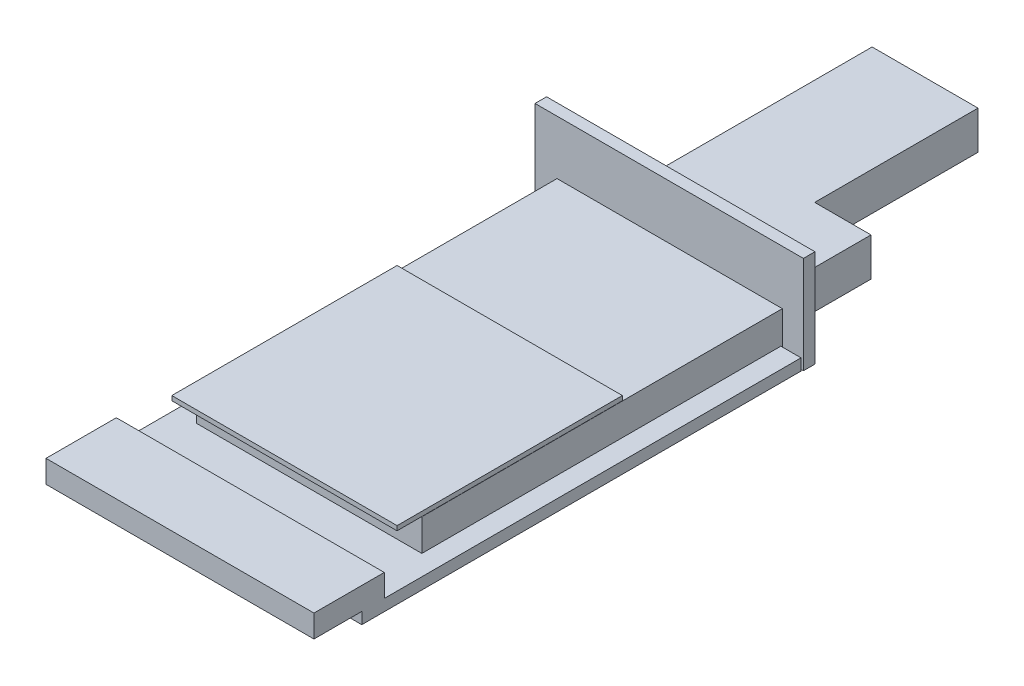
ISO-10303-21;
HEADER;
FILE_DESCRIPTION(('STEP AP214'),'2;1');
FILE_NAME('part.step','',(''),(''),'','','');
FILE_SCHEMA(('AUTOMOTIVE_DESIGN { 1 0 10303 214 1 1 1 1 }'));
ENDSEC;
DATA;
#1=APPLICATION_CONTEXT('core data for automotive mechanical design processes');
#2=APPLICATION_PROTOCOL_DEFINITION('international standard','automotive_design',2000,#1);
#3=PRODUCT_CONTEXT('',#1,'mechanical');
#4=PRODUCT('Part','Part','',(#3));
#5=PRODUCT_RELATED_PRODUCT_CATEGORY('part','',(#4));
#6=PRODUCT_DEFINITION_FORMATION('','',#4);
#7=PRODUCT_DEFINITION_CONTEXT('part definition',#1,'design');
#8=PRODUCT_DEFINITION('design','',#6,#7);
#9=PRODUCT_DEFINITION_SHAPE('','',#8);
#10=(LENGTH_UNIT() NAMED_UNIT(*) SI_UNIT(.MILLI.,.METRE.));
#11=(NAMED_UNIT(*) PLANE_ANGLE_UNIT() SI_UNIT($,.RADIAN.));
#12=(NAMED_UNIT(*) SI_UNIT($,.STERADIAN.) SOLID_ANGLE_UNIT());
#13=UNCERTAINTY_MEASURE_WITH_UNIT(LENGTH_MEASURE(1.E-05),#10,'distance_accuracy_value','');
#14=(GEOMETRIC_REPRESENTATION_CONTEXT(3) GLOBAL_UNCERTAINTY_ASSIGNED_CONTEXT((#13)) GLOBAL_UNIT_ASSIGNED_CONTEXT((#10,
#11,#12)) REPRESENTATION_CONTEXT('',''));
#15=CARTESIAN_POINT('',(0.,0.,0.));
#16=DIRECTION('',(0.,0.,1.));
#17=DIRECTION('',(1.,0.,0.));
#18=AXIS2_PLACEMENT_3D('',#15,#16,#17);
#19=CARTESIAN_POINT('',(-36.3929292491046,27.051,186.581238549588));
#20=DIRECTION('',(0.,0.,-1.));
#21=DIRECTION('',(-1.,0.,0.));
#22=AXIS2_PLACEMENT_3D('',#19,#20,#21);
#23=PLANE('',#22);
#24=DIRECTION('',(1.,0.,0.));
#25=VECTOR('',#24,1.);
#26=CARTESIAN_POINT('',(-36.3929292491046,24.511,186.581238549588));
#27=LINE('',#26,#25);
#28=CARTESIAN_POINT('',(-36.3929292491046,24.511,186.581238549588));
#29=VERTEX_POINT('',#28);
#30=CARTESIAN_POINT('',(90.6070707508954,24.511,186.581238549588));
#31=VERTEX_POINT('',#30);
#32=EDGE_CURVE('E107',#29,#31,#27,.T.);
#33=ORIENTED_EDGE('',*,*,#32,.F.);
#34=DIRECTION('',(0.,-1.,0.));
#35=VECTOR('',#34,1.);
#36=CARTESIAN_POINT('',(-36.3929292491046,27.051,186.581238549588));
#37=LINE('',#36,#35);
#38=CARTESIAN_POINT('',(-36.3929292491046,27.051,186.581238549588));
#39=VERTEX_POINT('',#38);
#40=EDGE_CURVE('E12',#39,#29,#37,.T.);
#41=ORIENTED_EDGE('',*,*,#40,.F.);
#42=DIRECTION('',(1.,0.,0.));
#43=VECTOR('',#42,1.);
#44=CARTESIAN_POINT('',(-36.3929292491046,27.051,186.581238549588));
#45=LINE('',#44,#43);
#46=CARTESIAN_POINT('',(90.6070707508954,27.051,186.581238549588));
#47=VERTEX_POINT('',#46);
#48=EDGE_CURVE('E102',#39,#47,#45,.T.);
#49=ORIENTED_EDGE('',*,*,#48,.T.);
#50=DIRECTION('',(0.,-1.,0.));
#51=VECTOR('',#50,1.);
#52=CARTESIAN_POINT('',(90.6070707508954,27.051,186.581238549588));
#53=LINE('',#52,#51);
#54=EDGE_CURVE('E45',#47,#31,#53,.T.);
#55=ORIENTED_EDGE('',*,*,#54,.T.);
#56=EDGE_LOOP('',(#33,#41,#49,#55));
#57=FACE_BOUND('',#56,.T.);
#58=ADVANCED_FACE('F42',(#57),#23,.T.);
#59=CARTESIAN_POINT('',(-36.3929292491046,27.051,186.581238549588));
#60=DIRECTION('',(1.,0.,0.));
#61=DIRECTION('',(0.,0.,-1.));
#62=AXIS2_PLACEMENT_3D('',#59,#60,#61);
#63=PLANE('',#62);
#64=DIRECTION('',(0.,0.,1.));
#65=VECTOR('',#64,1.);
#66=CARTESIAN_POINT('',(-36.3929292491046,24.511,186.581238549588));
#67=LINE('',#66,#65);
#68=CARTESIAN_POINT('',(-36.3929292491046,24.511,313.581238549588));
#69=VERTEX_POINT('',#68);
#70=EDGE_CURVE('E75',#29,#69,#67,.T.);
#71=ORIENTED_EDGE('',*,*,#70,.T.);
#72=DIRECTION('',(0.,-1.,0.));
#73=VECTOR('',#72,1.);
#74=CARTESIAN_POINT('',(-36.3929292491046,27.051,313.581238549588));
#75=LINE('',#74,#73);
#76=CARTESIAN_POINT('',(-36.3929292491046,27.051,313.581238549588));
#77=VERTEX_POINT('',#76);
#78=EDGE_CURVE('E51',#77,#69,#75,.T.);
#79=ORIENTED_EDGE('',*,*,#78,.F.);
#80=DIRECTION('',(0.,0.,1.));
#81=VECTOR('',#80,1.);
#82=CARTESIAN_POINT('',(-36.3929292491046,27.051,186.581238549588));
#83=LINE('',#82,#81);
#84=EDGE_CURVE('E92',#39,#77,#83,.T.);
#85=ORIENTED_EDGE('',*,*,#84,.F.);
#86=ORIENTED_EDGE('',*,*,#40,.T.);
#87=EDGE_LOOP('',(#71,#79,#85,#86));
#88=FACE_BOUND('',#87,.T.);
#89=ADVANCED_FACE('F117',(#88),#63,.F.);
#90=CARTESIAN_POINT('',(-36.3929292491046,27.051,313.581238549588));
#91=DIRECTION('',(0.,0.,-1.));
#92=DIRECTION('',(-1.,0.,0.));
#93=AXIS2_PLACEMENT_3D('',#90,#91,#92);
#94=PLANE('',#93);
#95=DIRECTION('',(1.,0.,0.));
#96=VECTOR('',#95,1.);
#97=CARTESIAN_POINT('',(-36.3929292491046,24.511,313.581238549588));
#98=LINE('',#97,#96);
#99=CARTESIAN_POINT('',(90.6070707508954,24.511,313.581238549588));
#100=VERTEX_POINT('',#99);
#101=EDGE_CURVE('E99',#69,#100,#98,.T.);
#102=ORIENTED_EDGE('',*,*,#101,.T.);
#103=DIRECTION('',(0.,-1.,0.));
#104=VECTOR('',#103,1.);
#105=CARTESIAN_POINT('',(90.6070707508954,27.051,313.581238549588));
#106=LINE('',#105,#104);
#107=CARTESIAN_POINT('',(90.6070707508954,27.051,313.581238549588));
#108=VERTEX_POINT('',#107);
#109=EDGE_CURVE('E96',#108,#100,#106,.T.);
#110=ORIENTED_EDGE('',*,*,#109,.F.);
#111=DIRECTION('',(1.,0.,0.));
#112=VECTOR('',#111,1.);
#113=CARTESIAN_POINT('',(-36.3929292491046,27.051,313.581238549588));
#114=LINE('',#113,#112);
#115=EDGE_CURVE('E87',#77,#108,#114,.T.);
#116=ORIENTED_EDGE('',*,*,#115,.F.);
#117=ORIENTED_EDGE('',*,*,#78,.T.);
#118=EDGE_LOOP('',(#102,#110,#116,#117));
#119=FACE_BOUND('',#118,.T.);
#120=ADVANCED_FACE('F97',(#119),#94,.F.);
#121=CARTESIAN_POINT('',(90.6070707508954,27.051,186.581238549588));
#122=DIRECTION('',(1.,0.,0.));
#123=DIRECTION('',(0.,0.,-1.));
#124=AXIS2_PLACEMENT_3D('',#121,#122,#123);
#125=PLANE('',#124);
#126=DIRECTION('',(0.,0.,1.));
#127=VECTOR('',#126,1.);
#128=CARTESIAN_POINT('',(90.6070707508954,24.511,186.581238549588));
#129=LINE('',#128,#127);
#130=EDGE_CURVE('E110',#31,#100,#129,.T.);
#131=ORIENTED_EDGE('',*,*,#130,.F.);
#132=ORIENTED_EDGE('',*,*,#54,.F.);
#133=DIRECTION('',(0.,0.,1.));
#134=VECTOR('',#133,1.);
#135=CARTESIAN_POINT('',(90.6070707508954,27.051,186.581238549588));
#136=LINE('',#135,#134);
#137=EDGE_CURVE('E91',#47,#108,#136,.T.);
#138=ORIENTED_EDGE('',*,*,#137,.T.);
#139=ORIENTED_EDGE('',*,*,#109,.T.);
#140=EDGE_LOOP('',(#131,#132,#138,#139));
#141=FACE_BOUND('',#140,.T.);
#142=ADVANCED_FACE('F101',(#141),#125,.T.);
#143=CARTESIAN_POINT('',(0.,27.051,0.));
#144=DIRECTION('',(0.,-1.,0.));
#145=DIRECTION('',(0.,0.,-1.));
#146=AXIS2_PLACEMENT_3D('',#143,#144,#145);
#147=PLANE('',#146);
#148=ORIENTED_EDGE('',*,*,#48,.F.);
#149=ORIENTED_EDGE('',*,*,#84,.T.);
#150=ORIENTED_EDGE('',*,*,#115,.T.);
#151=ORIENTED_EDGE('',*,*,#137,.F.);
#152=EDGE_LOOP('',(#148,#149,#150,#151));
#153=FACE_BOUND('',#152,.T.);
#154=ADVANCED_FACE('F90',(#153),#147,.F.);
#155=CARTESIAN_POINT('',(0.,24.511,0.));
#156=DIRECTION('',(0.,-1.,0.));
#157=DIRECTION('',(0.,0.,-1.));
#158=AXIS2_PLACEMENT_3D('',#155,#156,#157);
#159=PLANE('',#158);
#160=ORIENTED_EDGE('',*,*,#32,.T.);
#161=ORIENTED_EDGE('',*,*,#130,.T.);
#162=ORIENTED_EDGE('',*,*,#101,.F.);
#163=ORIENTED_EDGE('',*,*,#70,.F.);
#164=EDGE_LOOP('',(#160,#161,#162,#163));
#165=FACE_BOUND('',#164,.T.);
#166=ADVANCED_FACE('F115',(#165),#159,.T.);
#167=CLOSED_SHELL('',(#58,#89,#120,#142,#154,#166));
#168=MANIFOLD_SOLID_BREP('B2',#167);
#169=CARTESIAN_POINT('',(-48.7979055294522,54.864,89.8961385495878));
#170=DIRECTION('',(0.,0.,-1.));
#171=DIRECTION('',(-1.,0.,0.));
#172=AXIS2_PLACEMENT_3D('',#169,#170,#171);
#173=PLANE('',#172);
#174=DIRECTION('',(1.,0.,0.));
#175=VECTOR('',#174,1.);
#176=CARTESIAN_POINT('',(-48.7979055294522,0.,89.8961385495878));
#177=LINE('',#176,#175);
#178=CARTESIAN_POINT('',(-48.7979055294522,0.,89.8961385495878));
#179=VERTEX_POINT('',#178);
#180=CARTESIAN_POINT('',(102.504227111808,0.,89.8961385495878));
#181=VERTEX_POINT('',#180);
#182=EDGE_CURVE('E492',#179,#181,#177,.T.);
#183=ORIENTED_EDGE('',*,*,#182,.F.);
#184=DIRECTION('',(0.,-1.,0.));
#185=VECTOR('',#184,1.);
#186=CARTESIAN_POINT('',(-48.7979055294522,54.864,89.8961385495878));
#187=LINE('',#186,#185);
#188=CARTESIAN_POINT('',(-48.7979055294522,54.864,89.8961385495878));
#189=VERTEX_POINT('',#188);
#190=EDGE_CURVE('E489',#189,#179,#187,.T.);
#191=ORIENTED_EDGE('',*,*,#190,.F.);
#192=DIRECTION('',(1.,0.,0.));
#193=VECTOR('',#192,1.);
#194=CARTESIAN_POINT('',(-48.7979055294522,54.864,89.8961385495878));
#195=LINE('',#194,#193);
#196=CARTESIAN_POINT('',(102.504227111808,54.864,89.8961385495878));
#197=VERTEX_POINT('',#196);
#198=EDGE_CURVE('E481',#189,#197,#195,.T.);
#199=ORIENTED_EDGE('',*,*,#198,.T.);
#200=DIRECTION('',(0.,-1.,0.));
#201=VECTOR('',#200,1.);
#202=CARTESIAN_POINT('',(102.504227111808,54.864,89.8961385495878));
#203=LINE('',#202,#201);
#204=EDGE_CURVE('E506',#197,#181,#203,.T.);
#205=ORIENTED_EDGE('',*,*,#204,.T.);
#206=EDGE_LOOP('',(#183,#191,#199,#205));
#207=FACE_BOUND('',#206,.T.);
#208=DIRECTION('',(1.,0.,0.));
#209=VECTOR('',#208,1.);
#210=CARTESIAN_POINT('',(51.5320944705478,28.067,89.8961385495878));
#211=LINE('',#210,#209);
#212=CARTESIAN_POINT('',(-8.15790552945222,28.067,89.8961385495878));
#213=VERTEX_POINT('',#212);
#214=CARTESIAN_POINT('',(83.2820944705478,28.067,89.8961385495878));
#215=VERTEX_POINT('',#214);
#216=EDGE_CURVE('E363',#213,#215,#211,.T.);
#217=ORIENTED_EDGE('',*,*,#216,.F.);
#218=DIRECTION('',(0.,-1.,0.));
#219=VECTOR('',#218,1.);
#220=CARTESIAN_POINT('',(-8.15790552945222,28.067,89.8961385495878));
#221=LINE('',#220,#219);
#222=CARTESIAN_POINT('',(-8.15790552945222,6.477,89.8961385495878));
#223=VERTEX_POINT('',#222);
#224=EDGE_CURVE('E350',#213,#223,#221,.T.);
#225=ORIENTED_EDGE('',*,*,#224,.T.);
#226=DIRECTION('',(1.,0.,0.));
#227=VECTOR('',#226,1.);
#228=CARTESIAN_POINT('',(51.5320944705478,6.477,89.8961385495878));
#229=LINE('',#228,#227);
#230=CARTESIAN_POINT('',(83.2820944705478,6.477,89.8961385495878));
#231=VERTEX_POINT('',#230);
#232=EDGE_CURVE('E185',#223,#231,#229,.T.);
#233=ORIENTED_EDGE('',*,*,#232,.T.);
#234=DIRECTION('',(0.,-1.,0.));
#235=VECTOR('',#234,1.);
#236=CARTESIAN_POINT('',(83.2820944705478,28.067,89.8961385495878));
#237=LINE('',#236,#235);
#238=EDGE_CURVE('E180',#215,#231,#237,.T.);
#239=ORIENTED_EDGE('',*,*,#238,.F.);
#240=EDGE_LOOP('',(#217,#225,#233,#239));
#241=FACE_BOUND('',#240,.T.);
#242=ADVANCED_FACE('F165',(#207,#241),#173,.T.);
#243=CARTESIAN_POINT('',(-48.7979055294522,54.864,96.4112385495878));
#244=DIRECTION('',(0.,0.,-1.));
#245=DIRECTION('',(-1.,0.,0.));
#246=AXIS2_PLACEMENT_3D('',#243,#244,#245);
#247=PLANE('',#246);
#248=DIRECTION('',(0.,-1.,0.));
#249=VECTOR('',#248,1.);
#250=CARTESIAN_POINT('',(-36.3929292491046,24.384,96.4112385495878));
#251=LINE('',#250,#249);
#252=CARTESIAN_POINT('',(-36.3929292491046,24.384,96.4112385495878));
#253=VERTEX_POINT('',#252);
#254=CARTESIAN_POINT('',(-36.3929292491046,0.,96.4112385495878));
#255=VERTEX_POINT('',#254);
#256=EDGE_CURVE('E467',#253,#255,#251,.T.);
#257=ORIENTED_EDGE('',*,*,#256,.F.);
#258=DIRECTION('',(1.,0.,0.));
#259=VECTOR('',#258,1.);
#260=CARTESIAN_POINT('',(-36.3929292491046,24.384,96.4112385495878));
#261=LINE('',#260,#259);
#262=CARTESIAN_POINT('',(90.6070707508954,24.384,96.4112385495878));
#263=VERTEX_POINT('',#262);
#264=EDGE_CURVE('E451',#253,#263,#261,.T.);
#265=ORIENTED_EDGE('',*,*,#264,.T.);
#266=DIRECTION('',(0.,-1.,0.));
#267=VECTOR('',#266,1.);
#268=CARTESIAN_POINT('',(90.6070707508954,24.384,96.4112385495878));
#269=LINE('',#268,#267);
#270=CARTESIAN_POINT('',(90.6070707508954,0.,96.4112385495878));
#271=VERTEX_POINT('',#270);
#272=EDGE_CURVE('E462',#263,#271,#269,.T.);
#273=ORIENTED_EDGE('',*,*,#272,.T.);
#274=DIRECTION('',(1.,0.,0.));
#275=VECTOR('',#274,1.);
#276=CARTESIAN_POINT('',(-48.7979055294522,0.,96.4112385495878));
#277=LINE('',#276,#275);
#278=CARTESIAN_POINT('',(102.504227111808,0.,96.4112385495878));
#279=VERTEX_POINT('',#278);
#280=EDGE_CURVE('E498',#271,#279,#277,.T.);
#281=ORIENTED_EDGE('',*,*,#280,.T.);
#282=DIRECTION('',(0.,-1.,0.));
#283=VECTOR('',#282,1.);
#284=CARTESIAN_POINT('',(102.504227111808,54.864,96.4112385495878));
#285=LINE('',#284,#283);
#286=CARTESIAN_POINT('',(102.504227111808,54.864,96.4112385495878));
#287=VERTEX_POINT('',#286);
#288=EDGE_CURVE('E503',#287,#279,#285,.T.);
#289=ORIENTED_EDGE('',*,*,#288,.F.);
#290=DIRECTION('',(1.,0.,0.));
#291=VECTOR('',#290,1.);
#292=CARTESIAN_POINT('',(-48.7979055294522,54.864,96.4112385495878));
#293=LINE('',#292,#291);
#294=CARTESIAN_POINT('',(-48.7979055294522,54.864,96.4112385495878));
#295=VERTEX_POINT('',#294);
#296=EDGE_CURVE('E487',#295,#287,#293,.T.);
#297=ORIENTED_EDGE('',*,*,#296,.F.);
#298=DIRECTION('',(0.,-1.,0.));
#299=VECTOR('',#298,1.);
#300=CARTESIAN_POINT('',(-48.7979055294522,54.864,96.4112385495878));
#301=LINE('',#300,#299);
#302=CARTESIAN_POINT('',(-48.7979055294522,0.,96.4112385495878));
#303=VERTEX_POINT('',#302);
#304=EDGE_CURVE('E501',#295,#303,#301,.T.);
#305=ORIENTED_EDGE('',*,*,#304,.T.);
#306=EDGE_CURVE('E482',#303,#255,#277,.T.);
#307=ORIENTED_EDGE('',*,*,#306,.T.);
#308=EDGE_LOOP('',(#257,#265,#273,#281,#289,#297,#305,#307));
#309=FACE_BOUND('',#308,.T.);
#310=ADVANCED_FACE('F553',(#309),#247,.F.);
#311=CARTESIAN_POINT('',(-48.7979055294522,54.864,96.4112385495878));
#312=DIRECTION('',(-1.,0.,0.));
#313=DIRECTION('',(0.,0.,1.));
#314=AXIS2_PLACEMENT_3D('',#311,#312,#313);
#315=PLANE('',#314);
#316=DIRECTION('',(0.,0.,-1.));
#317=VECTOR('',#316,1.);
#318=CARTESIAN_POINT('',(-48.7979055294522,0.,96.4112385495878));
#319=LINE('',#318,#317);
#320=EDGE_CURVE('E469',#303,#179,#319,.T.);
#321=ORIENTED_EDGE('',*,*,#320,.F.);
#322=ORIENTED_EDGE('',*,*,#304,.F.);
#323=DIRECTION('',(0.,0.,-1.));
#324=VECTOR('',#323,1.);
#325=CARTESIAN_POINT('',(-48.7979055294522,54.864,96.4112385495878));
#326=LINE('',#325,#324);
#327=EDGE_CURVE('E478',#295,#189,#326,.T.);
#328=ORIENTED_EDGE('',*,*,#327,.T.);
#329=ORIENTED_EDGE('',*,*,#190,.T.);
#330=EDGE_LOOP('',(#321,#322,#328,#329));
#331=FACE_BOUND('',#330,.T.);
#332=ADVANCED_FACE('F167',(#331),#315,.T.);
#333=CARTESIAN_POINT('',(102.504227111808,54.864,96.4112385495878));
#334=DIRECTION('',(-1.,0.,0.));
#335=DIRECTION('',(0.,0.,1.));
#336=AXIS2_PLACEMENT_3D('',#333,#334,#335);
#337=PLANE('',#336);
#338=DIRECTION('',(0.,0.,-1.));
#339=VECTOR('',#338,1.);
#340=CARTESIAN_POINT('',(102.504227111808,0.,96.4112385495878));
#341=LINE('',#340,#339);
#342=EDGE_CURVE('E495',#279,#181,#341,.T.);
#343=ORIENTED_EDGE('',*,*,#342,.T.);
#344=ORIENTED_EDGE('',*,*,#204,.F.);
#345=DIRECTION('',(0.,0.,-1.));
#346=VECTOR('',#345,1.);
#347=CARTESIAN_POINT('',(102.504227111808,54.864,96.4112385495878));
#348=LINE('',#347,#346);
#349=EDGE_CURVE('E485',#287,#197,#348,.T.);
#350=ORIENTED_EDGE('',*,*,#349,.F.);
#351=ORIENTED_EDGE('',*,*,#288,.T.);
#352=EDGE_LOOP('',(#343,#344,#350,#351));
#353=FACE_BOUND('',#352,.T.);
#354=ADVANCED_FACE('F576',(#353),#337,.F.);
#355=CARTESIAN_POINT('',(0.,54.864,0.));
#356=DIRECTION('',(0.,-1.,0.));
#357=DIRECTION('',(0.,0.,-1.));
#358=AXIS2_PLACEMENT_3D('',#355,#356,#357);
#359=PLANE('',#358);
#360=ORIENTED_EDGE('',*,*,#327,.F.);
#361=ORIENTED_EDGE('',*,*,#296,.T.);
#362=ORIENTED_EDGE('',*,*,#349,.T.);
#363=ORIENTED_EDGE('',*,*,#198,.F.);
#364=EDGE_LOOP('',(#360,#361,#362,#363));
#365=FACE_BOUND('',#364,.T.);
#366=ADVANCED_FACE('F578',(#365),#359,.F.);
#367=CARTESIAN_POINT('',(0.,0.,0.));
#368=DIRECTION('',(0.,-1.,0.));
#369=DIRECTION('',(0.,0.,-1.));
#370=AXIS2_PLACEMENT_3D('',#367,#368,#369);
#371=PLANE('',#370);
#372=DIRECTION('',(0.,0.,1.));
#373=VECTOR('',#372,1.);
#374=CARTESIAN_POINT('',(90.6070707508954,0.,96.4112385495878));
#375=LINE('',#374,#373);
#376=CARTESIAN_POINT('',(90.6070707508954,0.,97.2338753010748));
#377=VERTEX_POINT('',#376);
#378=EDGE_CURVE('E450',#271,#377,#375,.T.);
#379=ORIENTED_EDGE('',*,*,#378,.T.);
#380=DIRECTION('',(1.,0.,0.));
#381=VECTOR('',#380,1.);
#382=CARTESIAN_POINT('',(-49.0662582819635,0.,97.2338753010748));
#383=LINE('',#382,#381);
#384=CARTESIAN_POINT('',(101.986287539261,0.,97.2338753010748));
#385=VERTEX_POINT('',#384);
#386=EDGE_CURVE('E429',#377,#385,#383,.T.);
#387=ORIENTED_EDGE('',*,*,#386,.T.);
#388=DIRECTION('',(0.,0.,1.));
#389=VECTOR('',#388,1.);
#390=CARTESIAN_POINT('',(101.986287539261,0.,97.2338753010748));
#391=LINE('',#390,#389);
#392=CARTESIAN_POINT('',(101.986287539261,0.,344.86889141452));
#393=VERTEX_POINT('',#392);
#394=EDGE_CURVE('E426',#385,#393,#391,.T.);
#395=ORIENTED_EDGE('',*,*,#394,.T.);
#396=DIRECTION('',(1.,0.,0.));
#397=VECTOR('',#396,1.);
#398=CARTESIAN_POINT('',(-49.0662582819635,0.,344.86889141452));
#399=LINE('',#398,#397);
#400=CARTESIAN_POINT('',(-49.0662582819635,0.,344.86889141452));
#401=VERTEX_POINT('',#400);
#402=EDGE_CURVE('E423',#401,#393,#399,.T.);
#403=ORIENTED_EDGE('',*,*,#402,.F.);
#404=DIRECTION('',(0.,0.,1.));
#405=VECTOR('',#404,1.);
#406=CARTESIAN_POINT('',(-49.0662582819635,0.,97.2338753010748));
#407=LINE('',#406,#405);
#408=CARTESIAN_POINT('',(-49.0662582819635,0.,97.2338753010748));
#409=VERTEX_POINT('',#408);
#410=EDGE_CURVE('E399',#409,#401,#407,.T.);
#411=ORIENTED_EDGE('',*,*,#410,.F.);
#412=CARTESIAN_POINT('',(-36.3929292491046,0.,97.2338753010748));
#413=VERTEX_POINT('',#412);
#414=EDGE_CURVE('E411',#409,#413,#383,.T.);
#415=ORIENTED_EDGE('',*,*,#414,.T.);
#416=DIRECTION('',(0.,0.,1.));
#417=VECTOR('',#416,1.);
#418=CARTESIAN_POINT('',(-36.3929292491046,0.,96.4112385495878));
#419=LINE('',#418,#417);
#420=EDGE_CURVE('E455',#255,#413,#419,.T.);
#421=ORIENTED_EDGE('',*,*,#420,.F.);
#422=ORIENTED_EDGE('',*,*,#306,.F.);
#423=ORIENTED_EDGE('',*,*,#320,.T.);
#424=ORIENTED_EDGE('',*,*,#182,.T.);
#425=ORIENTED_EDGE('',*,*,#342,.F.);
#426=ORIENTED_EDGE('',*,*,#280,.F.);
#427=EDGE_LOOP('',(#379,#387,#395,#403,#411,#415,#421,#422,#423,#424,#425,#426));
#428=FACE_BOUND('',#427,.T.);
#429=ADVANCED_FACE('F534',(#428),#371,.T.);
#430=CARTESIAN_POINT('',(-36.3929292491046,24.384,96.4112385495878));
#431=DIRECTION('',(1.,0.,0.));
#432=DIRECTION('',(0.,0.,-1.));
#433=AXIS2_PLACEMENT_3D('',#430,#431,#432);
#434=PLANE('',#433);
#435=DIRECTION('',(0.,1.,0.));
#436=VECTOR('',#435,1.);
#437=CARTESIAN_POINT('',(-36.3929292491046,24.384,97.2338753010748));
#438=LINE('',#437,#436);
#439=CARTESIAN_POINT('',(-36.3929292491046,6.477,97.2338753010748));
#440=VERTEX_POINT('',#439);
#441=EDGE_CURVE('E441',#413,#440,#438,.T.);
#442=ORIENTED_EDGE('',*,*,#441,.T.);
#443=DIRECTION('',(0.,0.,1.));
#444=VECTOR('',#443,1.);
#445=CARTESIAN_POINT('',(-36.3929292491046,6.477,96.4112385495878));
#446=LINE('',#445,#444);
#447=CARTESIAN_POINT('',(-36.3929292491046,6.477,299.611238549588));
#448=VERTEX_POINT('',#447);
#449=EDGE_CURVE('E447',#440,#448,#446,.T.);
#450=ORIENTED_EDGE('',*,*,#449,.T.);
#451=DIRECTION('',(0.,-1.,0.));
#452=VECTOR('',#451,1.);
#453=CARTESIAN_POINT('',(-36.3929292491046,24.384,299.611238549588));
#454=LINE('',#453,#452);
#455=CARTESIAN_POINT('',(-36.3929292491046,24.384,299.611238549588));
#456=VERTEX_POINT('',#455);
#457=EDGE_CURVE('E470',#456,#448,#454,.T.);
#458=ORIENTED_EDGE('',*,*,#457,.F.);
#459=DIRECTION('',(0.,0.,1.));
#460=VECTOR('',#459,1.);
#461=CARTESIAN_POINT('',(-36.3929292491046,24.384,96.4112385495878));
#462=LINE('',#461,#460);
#463=EDGE_CURVE('E460',#253,#456,#462,.T.);
#464=ORIENTED_EDGE('',*,*,#463,.F.);
#465=ORIENTED_EDGE('',*,*,#256,.T.);
#466=ORIENTED_EDGE('',*,*,#420,.T.);
#467=EDGE_LOOP('',(#442,#450,#458,#464,#465,#466));
#468=FACE_BOUND('',#467,.T.);
#469=ADVANCED_FACE('F527',(#468),#434,.F.);
#470=CARTESIAN_POINT('',(-36.3929292491046,24.384,299.611238549588));
#471=DIRECTION('',(0.,0.,-1.));
#472=DIRECTION('',(-1.,0.,0.));
#473=AXIS2_PLACEMENT_3D('',#470,#471,#472);
#474=PLANE('',#473);
#475=ORIENTED_EDGE('',*,*,#457,.T.);
#476=DIRECTION('',(1.,0.,0.));
#477=VECTOR('',#476,1.);
#478=CARTESIAN_POINT('',(-36.3929292491046,6.477,299.611238549588));
#479=LINE('',#478,#477);
#480=CARTESIAN_POINT('',(90.6070707508954,6.477,299.611238549588));
#481=VERTEX_POINT('',#480);
#482=EDGE_CURVE('E444',#448,#481,#479,.T.);
#483=ORIENTED_EDGE('',*,*,#482,.T.);
#484=DIRECTION('',(0.,-1.,0.));
#485=VECTOR('',#484,1.);
#486=CARTESIAN_POINT('',(90.6070707508954,24.384,299.611238549588));
#487=LINE('',#486,#485);
#488=CARTESIAN_POINT('',(90.6070707508954,24.384,299.611238549588));
#489=VERTEX_POINT('',#488);
#490=EDGE_CURVE('E473',#489,#481,#487,.T.);
#491=ORIENTED_EDGE('',*,*,#490,.F.);
#492=DIRECTION('',(1.,0.,0.));
#493=VECTOR('',#492,1.);
#494=CARTESIAN_POINT('',(-36.3929292491046,24.384,299.611238549588));
#495=LINE('',#494,#493);
#496=EDGE_CURVE('E458',#456,#489,#495,.T.);
#497=ORIENTED_EDGE('',*,*,#496,.F.);
#498=EDGE_LOOP('',(#475,#483,#491,#497));
#499=FACE_BOUND('',#498,.T.);
#500=ADVANCED_FACE('F523',(#499),#474,.F.);
#501=CARTESIAN_POINT('',(90.6070707508954,24.384,96.4112385495878));
#502=DIRECTION('',(1.,0.,0.));
#503=DIRECTION('',(0.,0.,-1.));
#504=AXIS2_PLACEMENT_3D('',#501,#502,#503);
#505=PLANE('',#504);
#506=DIRECTION('',(0.,0.,1.));
#507=VECTOR('',#506,1.);
#508=CARTESIAN_POINT('',(90.6070707508954,6.477,96.4112385495878));
#509=LINE('',#508,#507);
#510=CARTESIAN_POINT('',(90.6070707508954,6.477,97.2338753010748));
#511=VERTEX_POINT('',#510);
#512=EDGE_CURVE('E40',#511,#481,#509,.T.);
#513=ORIENTED_EDGE('',*,*,#512,.F.);
#514=DIRECTION('',(0.,1.,0.));
#515=VECTOR('',#514,1.);
#516=CARTESIAN_POINT('',(90.6070707508954,24.384,97.2338753010748));
#517=LINE('',#516,#515);
#518=EDGE_CURVE('E173',#377,#511,#517,.T.);
#519=ORIENTED_EDGE('',*,*,#518,.F.);
#520=ORIENTED_EDGE('',*,*,#378,.F.);
#521=ORIENTED_EDGE('',*,*,#272,.F.);
#522=DIRECTION('',(0.,0.,1.));
#523=VECTOR('',#522,1.);
#524=CARTESIAN_POINT('',(90.6070707508954,24.384,96.4112385495878));
#525=LINE('',#524,#523);
#526=EDGE_CURVE('E454',#263,#489,#525,.T.);
#527=ORIENTED_EDGE('',*,*,#526,.T.);
#528=ORIENTED_EDGE('',*,*,#490,.T.);
#529=EDGE_LOOP('',(#513,#519,#520,#521,#527,#528));
#530=FACE_BOUND('',#529,.T.);
#531=ADVANCED_FACE('F518',(#530),#505,.T.);
#532=CARTESIAN_POINT('',(0.,24.384,0.));
#533=DIRECTION('',(0.,-1.,0.));
#534=DIRECTION('',(0.,0.,-1.));
#535=AXIS2_PLACEMENT_3D('',#532,#533,#534);
#536=PLANE('',#535);
#537=ORIENTED_EDGE('',*,*,#264,.F.);
#538=ORIENTED_EDGE('',*,*,#463,.T.);
#539=ORIENTED_EDGE('',*,*,#496,.T.);
#540=ORIENTED_EDGE('',*,*,#526,.F.);
#541=EDGE_LOOP('',(#537,#538,#539,#540));
#542=FACE_BOUND('',#541,.T.);
#543=ADVANCED_FACE('F557',(#542),#536,.F.);
#544=CARTESIAN_POINT('',(0.,6.477,0.));
#545=DIRECTION('',(0.,1.,0.));
#546=DIRECTION('',(0.,0.,1.));
#547=AXIS2_PLACEMENT_3D('',#544,#545,#546);
#548=PLANE('',#547);
#549=ORIENTED_EDGE('',*,*,#449,.F.);
#550=DIRECTION('',(1.,0.,0.));
#551=VECTOR('',#550,1.);
#552=CARTESIAN_POINT('',(-49.0662582819635,6.477,97.2338753010748));
#553=LINE('',#552,#551);
#554=CARTESIAN_POINT('',(-49.0662582819635,6.477,97.2338753010748));
#555=VERTEX_POINT('',#554);
#556=EDGE_CURVE('E417',#555,#440,#553,.T.);
#557=ORIENTED_EDGE('',*,*,#556,.F.);
#558=DIRECTION('',(0.,0.,1.));
#559=VECTOR('',#558,1.);
#560=CARTESIAN_POINT('',(-49.0662582819635,6.477,97.2338753010748));
#561=LINE('',#560,#559);
#562=CARTESIAN_POINT('',(-49.0662582819635,6.477,332.16889141452));
#563=VERTEX_POINT('',#562);
#564=EDGE_CURVE('E407',#555,#563,#561,.T.);
#565=ORIENTED_EDGE('',*,*,#564,.T.);
#566=DIRECTION('',(1.,0.,0.));
#567=VECTOR('',#566,1.);
#568=CARTESIAN_POINT('',(-49.0662582819635,6.477,332.16889141452));
#569=LINE('',#568,#567);
#570=CARTESIAN_POINT('',(101.986287539261,6.477,332.16889141452));
#571=VERTEX_POINT('',#570);
#572=EDGE_CURVE('E373',#563,#571,#569,.T.);
#573=ORIENTED_EDGE('',*,*,#572,.T.);
#574=DIRECTION('',(0.,0.,1.));
#575=VECTOR('',#574,1.);
#576=CARTESIAN_POINT('',(101.986287539261,6.477,97.2338753010748));
#577=LINE('',#576,#575);
#578=CARTESIAN_POINT('',(101.986287539261,6.477,97.2338753010748));
#579=VERTEX_POINT('',#578);
#580=EDGE_CURVE('E413',#579,#571,#577,.T.);
#581=ORIENTED_EDGE('',*,*,#580,.F.);
#582=EDGE_CURVE('E416',#511,#579,#553,.T.);
#583=ORIENTED_EDGE('',*,*,#582,.F.);
#584=ORIENTED_EDGE('',*,*,#512,.T.);
#585=ORIENTED_EDGE('',*,*,#482,.F.);
#586=EDGE_LOOP('',(#549,#557,#565,#573,#581,#583,#584,#585));
#587=FACE_BOUND('',#586,.T.);
#588=ADVANCED_FACE('F517',(#587),#548,.T.);
#589=CARTESIAN_POINT('',(-49.0662582819635,6.477,97.2338753010748));
#590=DIRECTION('',(0.,0.,-1.));
#591=DIRECTION('',(-1.,0.,0.));
#592=AXIS2_PLACEMENT_3D('',#589,#590,#591);
#593=PLANE('',#592);
#594=ORIENTED_EDGE('',*,*,#441,.F.);
#595=ORIENTED_EDGE('',*,*,#414,.F.);
#596=DIRECTION('',(0.,-1.,0.));
#597=VECTOR('',#596,1.);
#598=CARTESIAN_POINT('',(-49.0662582819635,6.477,97.2338753010748));
#599=LINE('',#598,#597);
#600=EDGE_CURVE('E420',#555,#409,#599,.T.);
#601=ORIENTED_EDGE('',*,*,#600,.F.);
#602=ORIENTED_EDGE('',*,*,#556,.T.);
#603=EDGE_LOOP('',(#594,#595,#601,#602));
#604=FACE_BOUND('',#603,.T.);
#605=ADVANCED_FACE('F531',(#604),#593,.T.);
#606=CARTESIAN_POINT('',(-49.0662582819635,6.477,97.2338753010748));
#607=DIRECTION('',(1.,0.,0.));
#608=DIRECTION('',(0.,0.,-1.));
#609=AXIS2_PLACEMENT_3D('',#606,#607,#608);
#610=PLANE('',#609);
#611=ORIENTED_EDGE('',*,*,#410,.T.);
#612=DIRECTION('',(0.,-1.,0.));
#613=VECTOR('',#612,1.);
#614=CARTESIAN_POINT('',(-49.0662582819635,6.477,344.86889141452));
#615=LINE('',#614,#613);
#616=CARTESIAN_POINT('',(-49.0662582819635,6.477,344.86889141452));
#617=VERTEX_POINT('',#616);
#618=EDGE_CURVE('E438',#617,#401,#615,.T.);
#619=ORIENTED_EDGE('',*,*,#618,.F.);
#620=DIRECTION('',(0.,0.,1.));
#621=VECTOR('',#620,1.);
#622=CARTESIAN_POINT('',(-49.0662582819635,6.477,332.16889141452));
#623=LINE('',#622,#621);
#624=CARTESIAN_POINT('',(-49.0662582819635,6.477,371.816895116604));
#625=VERTEX_POINT('',#624);
#626=EDGE_CURVE('E381',#617,#625,#623,.T.);
#627=ORIENTED_EDGE('',*,*,#626,.T.);
#628=DIRECTION('',(0.,-1.,0.));
#629=VECTOR('',#628,1.);
#630=CARTESIAN_POINT('',(-49.0662582819635,19.177,371.816895116604));
#631=LINE('',#630,#629);
#632=CARTESIAN_POINT('',(-49.0662582819635,19.177,371.816895116604));
#633=VERTEX_POINT('',#632);
#634=EDGE_CURVE('E400',#633,#625,#631,.T.);
#635=ORIENTED_EDGE('',*,*,#634,.F.);
#636=DIRECTION('',(0.,0.,1.));
#637=VECTOR('',#636,1.);
#638=CARTESIAN_POINT('',(-49.0662582819635,19.177,332.16889141452));
#639=LINE('',#638,#637);
#640=CARTESIAN_POINT('',(-49.0662582819635,19.177,332.16889141452));
#641=VERTEX_POINT('',#640);
#642=EDGE_CURVE('E386',#641,#633,#639,.T.);
#643=ORIENTED_EDGE('',*,*,#642,.F.);
#644=DIRECTION('',(0.,-1.,0.));
#645=VECTOR('',#644,1.);
#646=CARTESIAN_POINT('',(-49.0662582819635,19.177,332.16889141452));
#647=LINE('',#646,#645);
#648=EDGE_CURVE('E397',#641,#563,#647,.T.);
#649=ORIENTED_EDGE('',*,*,#648,.T.);
#650=ORIENTED_EDGE('',*,*,#564,.F.);
#651=ORIENTED_EDGE('',*,*,#600,.T.);
#652=EDGE_LOOP('',(#611,#619,#627,#635,#643,#649,#650,#651));
#653=FACE_BOUND('',#652,.T.);
#654=ADVANCED_FACE('F538',(#653),#610,.F.);
#655=CARTESIAN_POINT('',(-49.0662582819635,6.477,344.86889141452));
#656=DIRECTION('',(0.,0.,-1.));
#657=DIRECTION('',(-1.,0.,0.));
#658=AXIS2_PLACEMENT_3D('',#655,#656,#657);
#659=PLANE('',#658);
#660=ORIENTED_EDGE('',*,*,#402,.T.);
#661=DIRECTION('',(0.,-1.,0.));
#662=VECTOR('',#661,1.);
#663=CARTESIAN_POINT('',(101.986287539261,6.477,344.86889141452));
#664=LINE('',#663,#662);
#665=CARTESIAN_POINT('',(101.986287539261,6.477,344.86889141452));
#666=VERTEX_POINT('',#665);
#667=EDGE_CURVE('E436',#666,#393,#664,.T.);
#668=ORIENTED_EDGE('',*,*,#667,.F.);
#669=DIRECTION('',(1.,0.,0.));
#670=VECTOR('',#669,1.);
#671=CARTESIAN_POINT('',(-49.0662582819635,6.477,344.86889141452));
#672=LINE('',#671,#670);
#673=EDGE_CURVE('E410',#617,#666,#672,.T.);
#674=ORIENTED_EDGE('',*,*,#673,.F.);
#675=ORIENTED_EDGE('',*,*,#618,.T.);
#676=EDGE_LOOP('',(#660,#668,#674,#675));
#677=FACE_BOUND('',#676,.T.);
#678=ADVANCED_FACE('F629',(#677),#659,.F.);
#679=CARTESIAN_POINT('',(101.986287539261,6.477,97.2338753010748));
#680=DIRECTION('',(1.,0.,0.));
#681=DIRECTION('',(0.,0.,-1.));
#682=AXIS2_PLACEMENT_3D('',#679,#680,#681);
#683=PLANE('',#682);
#684=ORIENTED_EDGE('',*,*,#394,.F.);
#685=DIRECTION('',(0.,-1.,0.));
#686=VECTOR('',#685,1.);
#687=CARTESIAN_POINT('',(101.986287539261,6.477,97.2338753010748));
#688=LINE('',#687,#686);
#689=EDGE_CURVE('E433',#579,#385,#688,.T.);
#690=ORIENTED_EDGE('',*,*,#689,.F.);
#691=ORIENTED_EDGE('',*,*,#580,.T.);
#692=DIRECTION('',(0.,-1.,0.));
#693=VECTOR('',#692,1.);
#694=CARTESIAN_POINT('',(101.986287539261,19.177,332.16889141452));
#695=LINE('',#694,#693);
#696=CARTESIAN_POINT('',(101.986287539261,19.177,332.16889141452));
#697=VERTEX_POINT('',#696);
#698=EDGE_CURVE('E388',#697,#571,#695,.T.);
#699=ORIENTED_EDGE('',*,*,#698,.F.);
#700=DIRECTION('',(0.,0.,1.));
#701=VECTOR('',#700,1.);
#702=CARTESIAN_POINT('',(101.986287539261,19.177,332.16889141452));
#703=LINE('',#702,#701);
#704=CARTESIAN_POINT('',(101.986287539261,19.177,371.816895116604));
#705=VERTEX_POINT('',#704);
#706=EDGE_CURVE('E380',#697,#705,#703,.T.);
#707=ORIENTED_EDGE('',*,*,#706,.T.);
#708=DIRECTION('',(0.,-1.,0.));
#709=VECTOR('',#708,1.);
#710=CARTESIAN_POINT('',(101.986287539261,19.177,371.816895116604));
#711=LINE('',#710,#709);
#712=CARTESIAN_POINT('',(101.986287539261,6.477,371.816895116604));
#713=VERTEX_POINT('',#712);
#714=EDGE_CURVE('E403',#705,#713,#711,.T.);
#715=ORIENTED_EDGE('',*,*,#714,.T.);
#716=DIRECTION('',(0.,0.,1.));
#717=VECTOR('',#716,1.);
#718=CARTESIAN_POINT('',(101.986287539261,6.477,332.16889141452));
#719=LINE('',#718,#717);
#720=EDGE_CURVE('E391',#666,#713,#719,.T.);
#721=ORIENTED_EDGE('',*,*,#720,.F.);
#722=ORIENTED_EDGE('',*,*,#667,.T.);
#723=EDGE_LOOP('',(#684,#690,#691,#699,#707,#715,#721,#722));
#724=FACE_BOUND('',#723,.T.);
#725=ADVANCED_FACE('F545',(#724),#683,.T.);
#726=ORIENTED_EDGE('',*,*,#386,.F.);
#727=ORIENTED_EDGE('',*,*,#518,.T.);
#728=ORIENTED_EDGE('',*,*,#582,.T.);
#729=ORIENTED_EDGE('',*,*,#689,.T.);
#730=EDGE_LOOP('',(#726,#727,#728,#729));
#731=FACE_BOUND('',#730,.T.);
#732=ADVANCED_FACE('F511',(#731),#593,.T.);
#733=CARTESIAN_POINT('',(-49.0662582819635,19.177,332.16889141452));
#734=DIRECTION('',(0.,0.,-1.));
#735=DIRECTION('',(-1.,0.,0.));
#736=AXIS2_PLACEMENT_3D('',#733,#734,#735);
#737=PLANE('',#736);
#738=ORIENTED_EDGE('',*,*,#572,.F.);
#739=ORIENTED_EDGE('',*,*,#648,.F.);
#740=DIRECTION('',(1.,0.,0.));
#741=VECTOR('',#740,1.);
#742=CARTESIAN_POINT('',(-49.0662582819635,19.177,332.16889141452));
#743=LINE('',#742,#741);
#744=EDGE_CURVE('E377',#641,#697,#743,.T.);
#745=ORIENTED_EDGE('',*,*,#744,.T.);
#746=ORIENTED_EDGE('',*,*,#698,.T.);
#747=EDGE_LOOP('',(#738,#739,#745,#746));
#748=FACE_BOUND('',#747,.T.);
#749=ADVANCED_FACE('F656',(#748),#737,.T.);
#750=CARTESIAN_POINT('',(-49.0662582819635,19.177,371.816895116604));
#751=DIRECTION('',(0.,0.,-1.));
#752=DIRECTION('',(-1.,0.,0.));
#753=AXIS2_PLACEMENT_3D('',#750,#751,#752);
#754=PLANE('',#753);
#755=DIRECTION('',(1.,0.,0.));
#756=VECTOR('',#755,1.);
#757=CARTESIAN_POINT('',(-49.0662582819635,6.477,371.816895116604));
#758=LINE('',#757,#756);
#759=EDGE_CURVE('E393',#625,#713,#758,.T.);
#760=ORIENTED_EDGE('',*,*,#759,.T.);
#761=ORIENTED_EDGE('',*,*,#714,.F.);
#762=DIRECTION('',(1.,0.,0.));
#763=VECTOR('',#762,1.);
#764=CARTESIAN_POINT('',(-49.0662582819635,19.177,371.816895116604));
#765=LINE('',#764,#763);
#766=EDGE_CURVE('E384',#633,#705,#765,.T.);
#767=ORIENTED_EDGE('',*,*,#766,.F.);
#768=ORIENTED_EDGE('',*,*,#634,.T.);
#769=EDGE_LOOP('',(#760,#761,#767,#768));
#770=FACE_BOUND('',#769,.T.);
#771=ADVANCED_FACE('F664',(#770),#754,.F.);
#772=CARTESIAN_POINT('',(0.,19.177,0.));
#773=DIRECTION('',(0.,-1.,0.));
#774=DIRECTION('',(0.,0.,-1.));
#775=AXIS2_PLACEMENT_3D('',#772,#773,#774);
#776=PLANE('',#775);
#777=ORIENTED_EDGE('',*,*,#744,.F.);
#778=ORIENTED_EDGE('',*,*,#642,.T.);
#779=ORIENTED_EDGE('',*,*,#766,.T.);
#780=ORIENTED_EDGE('',*,*,#706,.F.);
#781=EDGE_LOOP('',(#777,#778,#779,#780));
#782=FACE_BOUND('',#781,.T.);
#783=ADVANCED_FACE('F673',(#782),#776,.F.);
#784=CARTESIAN_POINT('',(0.,6.477,0.));
#785=DIRECTION('',(0.,-1.,0.));
#786=DIRECTION('',(0.,0.,-1.));
#787=AXIS2_PLACEMENT_3D('',#784,#785,#786);
#788=PLANE('',#787);
#789=ORIENTED_EDGE('',*,*,#626,.F.);
#790=ORIENTED_EDGE('',*,*,#673,.T.);
#791=ORIENTED_EDGE('',*,*,#720,.T.);
#792=ORIENTED_EDGE('',*,*,#759,.F.);
#793=EDGE_LOOP('',(#789,#790,#791,#792));
#794=FACE_BOUND('',#793,.T.);
#795=ADVANCED_FACE('F683',(#794),#788,.T.);
#796=CARTESIAN_POINT('',(83.2820944705478,28.067,89.8961385495878));
#797=DIRECTION('',(-1.,0.,0.));
#798=DIRECTION('',(0.,0.,1.));
#799=AXIS2_PLACEMENT_3D('',#796,#797,#798);
#800=PLANE('',#799);
#801=DIRECTION('',(0.,0.,-1.));
#802=VECTOR('',#801,1.);
#803=CARTESIAN_POINT('',(83.2820944705478,6.477,89.8961385495878));
#804=LINE('',#803,#802);
#805=CARTESIAN_POINT('',(83.2820944705478,6.477,39.0961385495878));
#806=VERTEX_POINT('',#805);
#807=EDGE_CURVE('E368',#231,#806,#804,.T.);
#808=ORIENTED_EDGE('',*,*,#807,.T.);
#809=DIRECTION('',(0.,-1.,0.));
#810=VECTOR('',#809,1.);
#811=CARTESIAN_POINT('',(83.2820944705478,28.067,39.0961385495878));
#812=LINE('',#811,#810);
#813=CARTESIAN_POINT('',(83.2820944705478,28.067,39.0961385495878));
#814=VERTEX_POINT('',#813);
#815=EDGE_CURVE('E374',#814,#806,#812,.T.);
#816=ORIENTED_EDGE('',*,*,#815,.F.);
#817=DIRECTION('',(0.,0.,-1.));
#818=VECTOR('',#817,1.);
#819=CARTESIAN_POINT('',(83.2820944705478,28.067,89.8961385495878));
#820=LINE('',#819,#818);
#821=EDGE_CURVE('E361',#215,#814,#820,.T.);
#822=ORIENTED_EDGE('',*,*,#821,.F.);
#823=ORIENTED_EDGE('',*,*,#238,.T.);
#824=EDGE_LOOP('',(#808,#816,#822,#823));
#825=FACE_BOUND('',#824,.T.);
#826=ADVANCED_FACE('F693',(#825),#800,.F.);
#827=CARTESIAN_POINT('',(51.5320944705478,28.067,39.0961385495878));
#828=DIRECTION('',(0.,0.,-1.));
#829=DIRECTION('',(-1.,0.,0.));
#830=AXIS2_PLACEMENT_3D('',#827,#828,#829);
#831=PLANE('',#830);
#832=DIRECTION('',(1.,0.,0.));
#833=VECTOR('',#832,1.);
#834=CARTESIAN_POINT('',(51.5320944705478,6.477,39.0961385495878));
#835=LINE('',#834,#833);
#836=CARTESIAN_POINT('',(51.5320944705478,6.477,39.0961385495878));
#837=VERTEX_POINT('',#836);
#838=EDGE_CURVE('E344',#837,#806,#835,.T.);
#839=ORIENTED_EDGE('',*,*,#838,.F.);
#840=DIRECTION('',(0.,-1.,0.));
#841=VECTOR('',#840,1.);
#842=CARTESIAN_POINT('',(51.5320944705478,28.067,39.0961385495878));
#843=LINE('',#842,#841);
#844=CARTESIAN_POINT('',(51.5320944705478,28.067,39.0961385495878));
#845=VERTEX_POINT('',#844);
#846=EDGE_CURVE('E365',#845,#837,#843,.T.);
#847=ORIENTED_EDGE('',*,*,#846,.F.);
#848=DIRECTION('',(1.,0.,0.));
#849=VECTOR('',#848,1.);
#850=CARTESIAN_POINT('',(51.5320944705478,28.067,39.0961385495878));
#851=LINE('',#850,#849);
#852=EDGE_CURVE('E331',#845,#814,#851,.T.);
#853=ORIENTED_EDGE('',*,*,#852,.T.);
#854=ORIENTED_EDGE('',*,*,#815,.T.);
#855=EDGE_LOOP('',(#839,#847,#853,#854));
#856=FACE_BOUND('',#855,.T.);
#857=ADVANCED_FACE('F702',(#856),#831,.T.);
#858=CARTESIAN_POINT('',(0.,28.067,0.));
#859=DIRECTION('',(0.,-1.,0.));
#860=DIRECTION('',(0.,0.,-1.));
#861=AXIS2_PLACEMENT_3D('',#858,#859,#860);
#862=PLANE('',#861);
#863=ORIENTED_EDGE('',*,*,#852,.F.);
#864=DIRECTION('',(0.,0.,-1.));
#865=VECTOR('',#864,1.);
#866=CARTESIAN_POINT('',(51.5320944705478,28.067,89.8961385495878));
#867=LINE('',#866,#865);
#868=CARTESIAN_POINT('',(51.5320944705478,28.067,-52.9788614504122));
#869=VERTEX_POINT('',#868);
#870=EDGE_CURVE('E323',#845,#869,#867,.T.);
#871=ORIENTED_EDGE('',*,*,#870,.T.);
#872=DIRECTION('',(1.,0.,0.));
#873=VECTOR('',#872,1.);
#874=CARTESIAN_POINT('',(-8.15790552945222,28.067,-52.9788614504122));
#875=LINE('',#874,#873);
#876=CARTESIAN_POINT('',(-8.15790552945222,28.067,-52.9788614504122));
#877=VERTEX_POINT('',#876);
#878=EDGE_CURVE('E328',#877,#869,#875,.T.);
#879=ORIENTED_EDGE('',*,*,#878,.F.);
#880=DIRECTION('',(0.,0.,-1.));
#881=VECTOR('',#880,1.);
#882=CARTESIAN_POINT('',(-8.15790552945222,28.067,89.8961385495878));
#883=LINE('',#882,#881);
#884=EDGE_CURVE('E348',#213,#877,#883,.T.);
#885=ORIENTED_EDGE('',*,*,#884,.F.);
#886=ORIENTED_EDGE('',*,*,#216,.T.);
#887=ORIENTED_EDGE('',*,*,#821,.T.);
#888=EDGE_LOOP('',(#863,#871,#879,#885,#886,#887));
#889=FACE_BOUND('',#888,.T.);
#890=ADVANCED_FACE('F325',(#889),#862,.F.);
#891=CARTESIAN_POINT('',(0.,6.477,0.));
#892=DIRECTION('',(0.,-1.,0.));
#893=DIRECTION('',(0.,0.,-1.));
#894=AXIS2_PLACEMENT_3D('',#891,#892,#893);
#895=PLANE('',#894);
#896=ORIENTED_EDGE('',*,*,#232,.F.);
#897=DIRECTION('',(0.,0.,-1.));
#898=VECTOR('',#897,1.);
#899=CARTESIAN_POINT('',(-8.15790552945222,6.477,89.8961385495878));
#900=LINE('',#899,#898);
#901=CARTESIAN_POINT('',(-8.15790552945222,6.477,-52.9788614504122));
#902=VERTEX_POINT('',#901);
#903=EDGE_CURVE('E335',#223,#902,#900,.T.);
#904=ORIENTED_EDGE('',*,*,#903,.T.);
#905=DIRECTION('',(1.,0.,0.));
#906=VECTOR('',#905,1.);
#907=CARTESIAN_POINT('',(-8.15790552945222,6.477,-52.9788614504122));
#908=LINE('',#907,#906);
#909=CARTESIAN_POINT('',(51.5320944705478,6.477,-52.9788614504122));
#910=VERTEX_POINT('',#909);
#911=EDGE_CURVE('E354',#902,#910,#908,.T.);
#912=ORIENTED_EDGE('',*,*,#911,.T.);
#913=DIRECTION('',(0.,0.,-1.));
#914=VECTOR('',#913,1.);
#915=CARTESIAN_POINT('',(51.5320944705478,6.477,89.8961385495878));
#916=LINE('',#915,#914);
#917=EDGE_CURVE('E340',#837,#910,#916,.T.);
#918=ORIENTED_EDGE('',*,*,#917,.F.);
#919=ORIENTED_EDGE('',*,*,#838,.T.);
#920=ORIENTED_EDGE('',*,*,#807,.F.);
#921=EDGE_LOOP('',(#896,#904,#912,#918,#919,#920));
#922=FACE_BOUND('',#921,.T.);
#923=ADVANCED_FACE('F728',(#922),#895,.T.);
#924=CARTESIAN_POINT('',(51.5320944705478,28.067,89.8961385495878));
#925=DIRECTION('',(-1.,0.,0.));
#926=DIRECTION('',(0.,0.,1.));
#927=AXIS2_PLACEMENT_3D('',#924,#925,#926);
#928=PLANE('',#927);
#929=ORIENTED_EDGE('',*,*,#846,.T.);
#930=ORIENTED_EDGE('',*,*,#917,.T.);
#931=DIRECTION('',(0.,-1.,0.));
#932=VECTOR('',#931,1.);
#933=CARTESIAN_POINT('',(51.5320944705478,28.067,-52.9788614504122));
#934=LINE('',#933,#932);
#935=EDGE_CURVE('E338',#869,#910,#934,.T.);
#936=ORIENTED_EDGE('',*,*,#935,.F.);
#937=ORIENTED_EDGE('',*,*,#870,.F.);
#938=EDGE_LOOP('',(#929,#930,#936,#937));
#939=FACE_BOUND('',#938,.T.);
#940=ADVANCED_FACE('F339',(#939),#928,.F.);
#941=CARTESIAN_POINT('',(-8.15790552945222,28.067,-52.9788614504122));
#942=DIRECTION('',(0.,0.,-1.));
#943=DIRECTION('',(-1.,0.,0.));
#944=AXIS2_PLACEMENT_3D('',#941,#942,#943);
#945=PLANE('',#944);
#946=ORIENTED_EDGE('',*,*,#911,.F.);
#947=DIRECTION('',(0.,-1.,0.));
#948=VECTOR('',#947,1.);
#949=CARTESIAN_POINT('',(-8.15790552945222,28.067,-52.9788614504122));
#950=LINE('',#949,#948);
#951=EDGE_CURVE('E345',#877,#902,#950,.T.);
#952=ORIENTED_EDGE('',*,*,#951,.F.);
#953=ORIENTED_EDGE('',*,*,#878,.T.);
#954=ORIENTED_EDGE('',*,*,#935,.T.);
#955=EDGE_LOOP('',(#946,#952,#953,#954));
#956=FACE_BOUND('',#955,.T.);
#957=ADVANCED_FACE('F347',(#956),#945,.T.);
#958=CARTESIAN_POINT('',(-8.15790552945222,28.067,89.8961385495878));
#959=DIRECTION('',(-1.,0.,0.));
#960=DIRECTION('',(0.,0.,1.));
#961=AXIS2_PLACEMENT_3D('',#958,#959,#960);
#962=PLANE('',#961);
#963=ORIENTED_EDGE('',*,*,#903,.F.);
#964=ORIENTED_EDGE('',*,*,#224,.F.);
#965=ORIENTED_EDGE('',*,*,#884,.T.);
#966=ORIENTED_EDGE('',*,*,#951,.T.);
#967=EDGE_LOOP('',(#963,#964,#965,#966));
#968=FACE_BOUND('',#967,.T.);
#969=ADVANCED_FACE('F754',(#968),#962,.T.);
#970=CLOSED_SHELL('',(#242,#310,#332,#354,#366,#429,#469,#500,#531,#543,#588,#605,#654,#678,
#725,#732,#749,#771,#783,#795,#826,#857,#890,#923,#940,#957,#969));
#971=MANIFOLD_SOLID_BREP('B6',#970);
#972=ADVANCED_BREP_SHAPE_REPRESENTATION('',(#18,#168,#971),#14);
#973=SHAPE_DEFINITION_REPRESENTATION(#9,#972);
ENDSEC;
END-ISO-10303-21;
